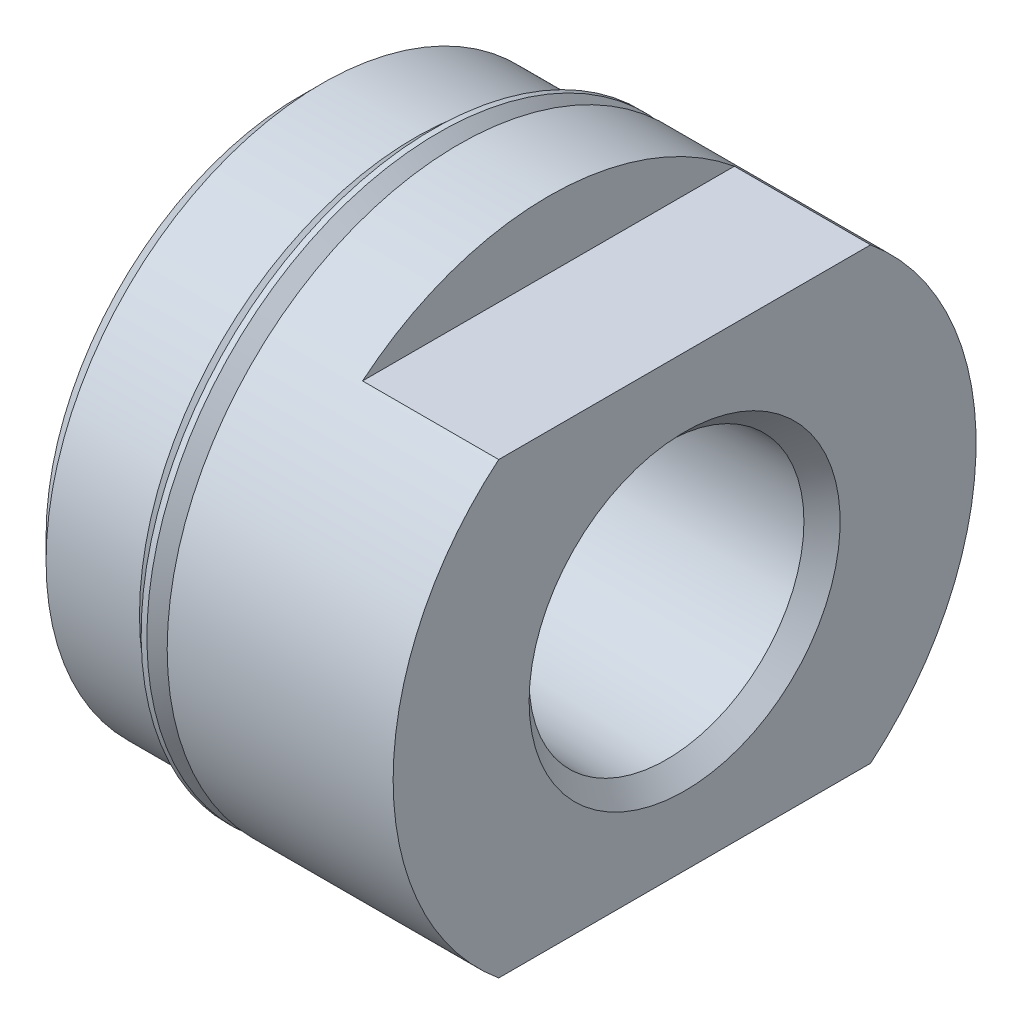
ISO-10303-21;
HEADER;
FILE_DESCRIPTION(('STEP AP214'),'2;1');
FILE_NAME('part.step','',(''),(''),'','','');
FILE_SCHEMA(('AUTOMOTIVE_DESIGN { 1 0 10303 214 1 1 1 1 }'));
ENDSEC;
DATA;
#1=APPLICATION_CONTEXT('core data for automotive mechanical design processes');
#2=APPLICATION_PROTOCOL_DEFINITION('international standard','automotive_design',2000,#1);
#3=PRODUCT_CONTEXT('',#1,'mechanical');
#4=PRODUCT('Part','Part','',(#3));
#5=PRODUCT_RELATED_PRODUCT_CATEGORY('part','',(#4));
#6=PRODUCT_DEFINITION_FORMATION('','',#4);
#7=PRODUCT_DEFINITION_CONTEXT('part definition',#1,'design');
#8=PRODUCT_DEFINITION('design','',#6,#7);
#9=PRODUCT_DEFINITION_SHAPE('','',#8);
#10=(LENGTH_UNIT() NAMED_UNIT(*) SI_UNIT(.MILLI.,.METRE.));
#11=(NAMED_UNIT(*) PLANE_ANGLE_UNIT() SI_UNIT($,.RADIAN.));
#12=(NAMED_UNIT(*) SI_UNIT($,.STERADIAN.) SOLID_ANGLE_UNIT());
#13=UNCERTAINTY_MEASURE_WITH_UNIT(LENGTH_MEASURE(1.E-05),#10,'distance_accuracy_value','');
#14=(GEOMETRIC_REPRESENTATION_CONTEXT(3) GLOBAL_UNCERTAINTY_ASSIGNED_CONTEXT((#13)) GLOBAL_UNIT_ASSIGNED_CONTEXT((#10,
#11,#12)) REPRESENTATION_CONTEXT('',''));
#15=CARTESIAN_POINT('',(0.,0.,0.));
#16=DIRECTION('',(0.,0.,1.));
#17=DIRECTION('',(1.,0.,0.));
#18=AXIS2_PLACEMENT_3D('',#15,#16,#17);
#19=CARTESIAN_POINT('',(13.4874,0.,0.));
#20=DIRECTION('',(-1.,0.,0.));
#21=DIRECTION('',(0.,0.,1.));
#22=AXIS2_PLACEMENT_3D('',#19,#20,#21);
#23=CYLINDRICAL_SURFACE('',#22,8.90905);
#24=CARTESIAN_POINT('',(4.8006,0.,0.));
#25=DIRECTION('',(-1.,0.,0.));
#26=DIRECTION('',(0.,0.,1.));
#27=AXIS2_PLACEMENT_3D('',#24,#25,#26);
#28=CIRCLE('',#27,8.90905);
#29=CARTESIAN_POINT('',(4.8006,0.,8.90905));
#30=VERTEX_POINT('',#29);
#31=EDGE_CURVE('E117',#30,#30,#28,.T.);
#32=ORIENTED_EDGE('',*,*,#31,.F.);
#33=EDGE_LOOP('',(#32));
#34=FACE_BOUND('',#33,.T.);
#35=CARTESIAN_POINT('',(5.18159999999989,0.,0.));
#36=DIRECTION('',(1.,0.,0.));
#37=DIRECTION('',(0.,1.,0.));
#38=AXIS2_PLACEMENT_3D('',#35,#36,#37);
#39=CIRCLE('',#38,8.90905);
#40=CARTESIAN_POINT('',(5.18159999999996,8.90904999999996,0.));
#41=VERTEX_POINT('',#40);
#42=EDGE_CURVE('E11',#41,#41,#39,.T.);
#43=ORIENTED_EDGE('',*,*,#42,.F.);
#44=EDGE_LOOP('',(#43));
#45=FACE_BOUND('',#44,.T.);
#46=ADVANCED_FACE('F41',(#34,#45),#23,.T.);
#47=CARTESIAN_POINT('',(5.5626,8.90905,0.));
#48=DIRECTION('',(1.,0.,0.));
#49=DIRECTION('',(0.,0.,-1.));
#50=AXIS2_PLACEMENT_3D('',#47,#48,#49);
#51=PLANE('',#50);
#52=CARTESIAN_POINT('',(5.5626,0.,0.));
#53=DIRECTION('',(-1.,0.,0.));
#54=DIRECTION('',(0.,0.,1.));
#55=AXIS2_PLACEMENT_3D('',#52,#53,#54);
#56=CIRCLE('',#55,10.2235);
#57=CARTESIAN_POINT('',(5.5626,0.,10.2235));
#58=VERTEX_POINT('',#57);
#59=EDGE_CURVE('E108',#58,#58,#56,.T.);
#60=ORIENTED_EDGE('',*,*,#59,.T.);
#61=EDGE_LOOP('',(#60));
#62=FACE_BOUND('',#61,.T.);
#63=CARTESIAN_POINT('',(5.5626,0.,0.));
#64=DIRECTION('',(1.,0.,0.));
#65=DIRECTION('',(0.,0.,-1.));
#66=AXIS2_PLACEMENT_3D('',#63,#64,#65);
#67=CIRCLE('',#66,9.51204893040247);
#68=CARTESIAN_POINT('',(5.5626,0.,-9.51204893040254));
#69=VERTEX_POINT('',#68);
#70=EDGE_CURVE('E49',#69,#69,#67,.F.);
#71=ORIENTED_EDGE('',*,*,#70,.F.);
#72=EDGE_LOOP('',(#71));
#73=FACE_BOUND('',#72,.T.);
#74=ADVANCED_FACE('F139',(#62,#73),#51,.F.);
#75=CARTESIAN_POINT('',(13.4874,10.2235,0.));
#76=DIRECTION('',(-1.,0.,0.));
#77=DIRECTION('',(0.,0.,1.));
#78=AXIS2_PLACEMENT_3D('',#75,#76,#77);
#79=PLANE('',#78);
#80=CARTESIAN_POINT('',(13.4874000000002,0.,0.));
#81=DIRECTION('',(-1.,0.,0.));
#82=DIRECTION('',(0.,0.,1.));
#83=AXIS2_PLACEMENT_3D('',#80,#81,#82);
#84=CIRCLE('',#83,5.45466392515005);
#85=CARTESIAN_POINT('',(13.4874000000002,0.,5.45466392515005));
#86=VERTEX_POINT('',#85);
#87=EDGE_CURVE('E197',#86,#86,#84,.T.);
#88=ORIENTED_EDGE('',*,*,#87,.T.);
#89=EDGE_LOOP('',(#88));
#90=FACE_BOUND('',#89,.T.);
#91=DIRECTION('',(0.,0.,1.));
#92=VECTOR('',#91,1.);
#93=CARTESIAN_POINT('',(13.4874,7.874,-20.447));
#94=LINE('',#93,#92);
#95=CARTESIAN_POINT('',(13.4874,7.874,-6.52074200149032));
#96=VERTEX_POINT('',#95);
#97=CARTESIAN_POINT('',(13.4874,7.874,6.52074200149032));
#98=VERTEX_POINT('',#97);
#99=EDGE_CURVE('E90',#96,#98,#94,.T.);
#100=ORIENTED_EDGE('',*,*,#99,.T.);
#101=CARTESIAN_POINT('',(13.4874,0.,0.));
#102=DIRECTION('',(-1.,0.,0.));
#103=DIRECTION('',(0.,0.,1.));
#104=AXIS2_PLACEMENT_3D('',#101,#102,#103);
#105=CIRCLE('',#104,10.2235);
#106=CARTESIAN_POINT('',(13.4874,-7.874,6.52074200149032));
#107=VERTEX_POINT('',#106);
#108=EDGE_CURVE('E99',#107,#98,#105,.T.);
#109=ORIENTED_EDGE('',*,*,#108,.F.);
#110=DIRECTION('',(0.,0.,-1.));
#111=VECTOR('',#110,1.);
#112=CARTESIAN_POINT('',(13.4874,-7.874,20.447));
#113=LINE('',#112,#111);
#114=CARTESIAN_POINT('',(13.4874,-7.874,-6.52074200149032));
#115=VERTEX_POINT('',#114);
#116=EDGE_CURVE('E80',#107,#115,#113,.T.);
#117=ORIENTED_EDGE('',*,*,#116,.T.);
#118=EDGE_CURVE('E105',#96,#115,#105,.T.);
#119=ORIENTED_EDGE('',*,*,#118,.F.);
#120=EDGE_LOOP('',(#100,#109,#117,#119));
#121=FACE_BOUND('',#120,.T.);
#122=ADVANCED_FACE('F104',(#90,#121),#79,.F.);
#123=CARTESIAN_POINT('',(13.4874,0.,0.));
#124=DIRECTION('',(-1.,0.,0.));
#125=DIRECTION('',(0.,0.,1.));
#126=AXIS2_PLACEMENT_3D('',#123,#124,#125);
#127=CYLINDRICAL_SURFACE('',#126,10.2235);
#128=ORIENTED_EDGE('',*,*,#59,.F.);
#129=EDGE_LOOP('',(#128));
#130=FACE_BOUND('',#129,.T.);
#131=DIRECTION('',(-1.,0.,0.));
#132=VECTOR('',#131,1.);
#133=CARTESIAN_POINT('',(13.4874,7.874,-6.52074200149032));
#134=LINE('',#133,#132);
#135=CARTESIAN_POINT('',(8.7122,7.874,-6.52074200149032));
#136=VERTEX_POINT('',#135);
#137=EDGE_CURVE('E133',#96,#136,#134,.T.);
#138=ORIENTED_EDGE('',*,*,#137,.F.);
#139=ORIENTED_EDGE('',*,*,#118,.T.);
#140=DIRECTION('',(-1.,0.,0.));
#141=VECTOR('',#140,1.);
#142=CARTESIAN_POINT('',(13.4874,-7.874,-6.52074200149032));
#143=LINE('',#142,#141);
#144=CARTESIAN_POINT('',(8.7122,-7.874,-6.52074200149032));
#145=VERTEX_POINT('',#144);
#146=EDGE_CURVE('E85',#145,#115,#143,.F.);
#147=ORIENTED_EDGE('',*,*,#146,.F.);
#148=CARTESIAN_POINT('',(8.7122,0.,0.));
#149=DIRECTION('',(1.,0.,0.));
#150=DIRECTION('',(0.,0.,-1.));
#151=AXIS2_PLACEMENT_3D('',#148,#149,#150);
#152=CIRCLE('',#151,10.2235);
#153=CARTESIAN_POINT('',(8.7122,-7.874,6.52074200149032));
#154=VERTEX_POINT('',#153);
#155=EDGE_CURVE('E100',#154,#145,#152,.T.);
#156=ORIENTED_EDGE('',*,*,#155,.F.);
#157=DIRECTION('',(-1.,0.,0.));
#158=VECTOR('',#157,1.);
#159=CARTESIAN_POINT('',(13.4874,-7.874,6.52074200149032));
#160=LINE('',#159,#158);
#161=EDGE_CURVE('E83',#107,#154,#160,.T.);
#162=ORIENTED_EDGE('',*,*,#161,.F.);
#163=ORIENTED_EDGE('',*,*,#108,.T.);
#164=DIRECTION('',(-1.,0.,0.));
#165=VECTOR('',#164,1.);
#166=CARTESIAN_POINT('',(13.4874,7.874,6.52074200149032));
#167=LINE('',#166,#165);
#168=CARTESIAN_POINT('',(8.7122,7.874,6.52074200149032));
#169=VERTEX_POINT('',#168);
#170=EDGE_CURVE('E101',#169,#98,#167,.F.);
#171=ORIENTED_EDGE('',*,*,#170,.F.);
#172=EDGE_CURVE('E130',#136,#169,#152,.T.);
#173=ORIENTED_EDGE('',*,*,#172,.F.);
#174=EDGE_LOOP('',(#138,#139,#147,#156,#162,#163,#171,#173));
#175=FACE_BOUND('',#174,.T.);
#176=ADVANCED_FACE('F97',(#130,#175),#127,.T.);
#177=CARTESIAN_POINT('',(0.,0.,0.));
#178=DIRECTION('',(1.,0.,0.));
#179=DIRECTION('',(0.,0.,-1.));
#180=AXIS2_PLACEMENT_3D('',#177,#178,#179);
#181=PLANE('',#180);
#182=CARTESIAN_POINT('',(0.,0.,0.));
#183=DIRECTION('',(-1.,0.,0.));
#184=DIRECTION('',(0.,0.,1.));
#185=AXIS2_PLACEMENT_3D('',#182,#183,#184);
#186=CIRCLE('',#185,8.90905);
#187=CARTESIAN_POINT('',(0.,0.,8.90905));
#188=VERTEX_POINT('',#187);
#189=EDGE_CURVE('E126',#188,#188,#186,.T.);
#190=ORIENTED_EDGE('',*,*,#189,.T.);
#191=EDGE_LOOP('',(#190));
#192=FACE_BOUND('',#191,.T.);
#193=CARTESIAN_POINT('',(0.,0.,0.));
#194=DIRECTION('',(1.,0.,0.));
#195=DIRECTION('',(0.,0.,-1.));
#196=AXIS2_PLACEMENT_3D('',#193,#194,#195);
#197=CIRCLE('',#196,4.41840547597906);
#198=CARTESIAN_POINT('',(0.,0.,-4.41840547597906));
#199=VERTEX_POINT('',#198);
#200=EDGE_CURVE('E106',#199,#199,#197,.F.);
#201=ORIENTED_EDGE('',*,*,#200,.F.);
#202=EDGE_LOOP('',(#201));
#203=FACE_BOUND('',#202,.T.);
#204=ADVANCED_FACE('F43',(#192,#203),#181,.F.);
#205=CARTESIAN_POINT('',(0.762000000000001,0.,0.));
#206=DIRECTION('',(1.,0.,0.));
#207=DIRECTION('',(0.,0.,-1.));
#208=AXIS2_PLACEMENT_3D('',#205,#206,#207);
#209=CONICAL_SURFACE('',#208,9.67105,0.785398163397447);
#210=ORIENTED_EDGE('',*,*,#189,.F.);
#211=EDGE_LOOP('',(#210));
#212=FACE_BOUND('',#211,.T.);
#213=CARTESIAN_POINT('',(0.762000000000001,0.,0.));
#214=DIRECTION('',(-1.,0.,0.));
#215=DIRECTION('',(0.,0.,1.));
#216=AXIS2_PLACEMENT_3D('',#213,#214,#215);
#217=CIRCLE('',#216,9.67105);
#218=CARTESIAN_POINT('',(0.762000000000001,0.,9.67105));
#219=VERTEX_POINT('',#218);
#220=EDGE_CURVE('E123',#219,#219,#217,.T.);
#221=ORIENTED_EDGE('',*,*,#220,.T.);
#222=EDGE_LOOP('',(#221));
#223=FACE_BOUND('',#222,.T.);
#224=ADVANCED_FACE('F160',(#212,#223),#209,.T.);
#225=CARTESIAN_POINT('',(13.4874,0.,0.));
#226=DIRECTION('',(-1.,0.,0.));
#227=DIRECTION('',(0.,0.,1.));
#228=AXIS2_PLACEMENT_3D('',#225,#226,#227);
#229=CYLINDRICAL_SURFACE('',#228,9.67105);
#230=ORIENTED_EDGE('',*,*,#220,.F.);
#231=EDGE_LOOP('',(#230));
#232=FACE_BOUND('',#231,.T.);
#233=CARTESIAN_POINT('',(4.0386,0.,0.));
#234=DIRECTION('',(-1.,0.,0.));
#235=DIRECTION('',(0.,0.,1.));
#236=AXIS2_PLACEMENT_3D('',#233,#234,#235);
#237=CIRCLE('',#236,9.67105);
#238=CARTESIAN_POINT('',(4.0386,0.,9.67105));
#239=VERTEX_POINT('',#238);
#240=EDGE_CURVE('E120',#239,#239,#237,.T.);
#241=ORIENTED_EDGE('',*,*,#240,.T.);
#242=EDGE_LOOP('',(#241));
#243=FACE_BOUND('',#242,.T.);
#244=ADVANCED_FACE('F157',(#232,#243),#229,.T.);
#245=CARTESIAN_POINT('',(4.8006,0.,0.));
#246=DIRECTION('',(-1.,0.,0.));
#247=DIRECTION('',(0.,0.,1.));
#248=AXIS2_PLACEMENT_3D('',#245,#246,#247);
#249=CONICAL_SURFACE('',#248,8.90905,0.785398163397447);
#250=ORIENTED_EDGE('',*,*,#240,.F.);
#251=EDGE_LOOP('',(#250));
#252=FACE_BOUND('',#251,.T.);
#253=ORIENTED_EDGE('',*,*,#31,.T.);
#254=EDGE_LOOP('',(#253));
#255=FACE_BOUND('',#254,.T.);
#256=ADVANCED_FACE('F153',(#252,#255),#249,.T.);
#257=CARTESIAN_POINT('',(12.852387191015,0.,0.));
#258=DIRECTION('',(1.,0.,0.));
#259=DIRECTION('',(0.,0.,-1.));
#260=AXIS2_PLACEMENT_3D('',#257,#258,#259);
#261=CONICAL_SURFACE('',#260,4.8196511161649,0.0312094049979799);
#262=CARTESIAN_POINT('',(12.852387191015,0.,0.));
#263=DIRECTION('',(-1.,0.,0.));
#264=DIRECTION('',(0.,0.,1.));
#265=AXIS2_PLACEMENT_3D('',#262,#263,#264);
#266=CIRCLE('',#265,4.8196511161649);
#267=CARTESIAN_POINT('',(12.852387191015,0.,4.8196511161649));
#268=VERTEX_POINT('',#267);
#269=EDGE_CURVE('E110',#268,#268,#266,.T.);
#270=ORIENTED_EDGE('',*,*,#269,.F.);
#271=EDGE_LOOP('',(#270));
#272=FACE_BOUND('',#271,.T.);
#273=ORIENTED_EDGE('',*,*,#200,.T.);
#274=EDGE_LOOP('',(#273));
#275=FACE_BOUND('',#274,.T.);
#276=ADVANCED_FACE('F156',(#272,#275),#261,.F.);
#277=CARTESIAN_POINT('',(13.4874000000002,0.,0.));
#278=DIRECTION('',(1.,0.,0.));
#279=DIRECTION('',(0.,0.,-1.));
#280=AXIS2_PLACEMENT_3D('',#277,#278,#279);
#281=CONICAL_SURFACE('',#280,5.45466392515005,0.785398163397449);
#282=ORIENTED_EDGE('',*,*,#269,.T.);
#283=EDGE_LOOP('',(#282));
#284=FACE_BOUND('',#283,.T.);
#285=ORIENTED_EDGE('',*,*,#87,.F.);
#286=EDGE_LOOP('',(#285));
#287=FACE_BOUND('',#286,.T.);
#288=ADVANCED_FACE('F204',(#284,#287),#281,.F.);
#289=CARTESIAN_POINT('',(8.7122,-7.874,20.447));
#290=DIRECTION('',(0.,-1.,0.));
#291=DIRECTION('',(0.,0.,-1.));
#292=AXIS2_PLACEMENT_3D('',#289,#290,#291);
#293=PLANE('',#292);
#294=ORIENTED_EDGE('',*,*,#161,.T.);
#295=DIRECTION('',(0.,0.,-1.));
#296=VECTOR('',#295,1.);
#297=CARTESIAN_POINT('',(8.7122,-7.874,20.447));
#298=LINE('',#297,#296);
#299=EDGE_CURVE('E64',#154,#145,#298,.T.);
#300=ORIENTED_EDGE('',*,*,#299,.T.);
#301=ORIENTED_EDGE('',*,*,#146,.T.);
#302=ORIENTED_EDGE('',*,*,#116,.F.);
#303=EDGE_LOOP('',(#294,#300,#301,#302));
#304=FACE_BOUND('',#303,.T.);
#305=ADVANCED_FACE('F82',(#304),#293,.T.);
#306=CARTESIAN_POINT('',(8.7122,0.,0.));
#307=DIRECTION('',(1.,0.,0.));
#308=DIRECTION('',(0.,0.,-1.));
#309=AXIS2_PLACEMENT_3D('',#306,#307,#308);
#310=PLANE('',#309);
#311=ORIENTED_EDGE('',*,*,#155,.T.);
#312=ORIENTED_EDGE('',*,*,#299,.F.);
#313=EDGE_LOOP('',(#311,#312));
#314=FACE_BOUND('',#313,.T.);
#315=ADVANCED_FACE('F221',(#314),#310,.T.);
#316=ORIENTED_EDGE('',*,*,#172,.T.);
#317=DIRECTION('',(0.,0.,1.));
#318=VECTOR('',#317,1.);
#319=CARTESIAN_POINT('',(8.7122,7.874,-20.447));
#320=LINE('',#319,#318);
#321=EDGE_CURVE('E56',#136,#169,#320,.T.);
#322=ORIENTED_EDGE('',*,*,#321,.F.);
#323=EDGE_LOOP('',(#316,#322));
#324=FACE_BOUND('',#323,.T.);
#325=ADVANCED_FACE('F217',(#324),#310,.T.);
#326=CARTESIAN_POINT('',(8.7122,7.874,-20.447));
#327=DIRECTION('',(0.,1.,0.));
#328=DIRECTION('',(0.,0.,1.));
#329=AXIS2_PLACEMENT_3D('',#326,#327,#328);
#330=PLANE('',#329);
#331=ORIENTED_EDGE('',*,*,#137,.T.);
#332=ORIENTED_EDGE('',*,*,#321,.T.);
#333=ORIENTED_EDGE('',*,*,#170,.T.);
#334=ORIENTED_EDGE('',*,*,#99,.F.);
#335=EDGE_LOOP('',(#331,#332,#333,#334));
#336=FACE_BOUND('',#335,.T.);
#337=ADVANCED_FACE('F220',(#336),#330,.T.);
#338=CARTESIAN_POINT('',(5.5625999999999,0.,0.));
#339=DIRECTION('',(-1.,0.,0.));
#340=DIRECTION('',(0.,-1.,0.));
#341=AXIS2_PLACEMENT_3D('',#338,#339,#340);
#342=CYLINDRICAL_SURFACE('',#341,10.2235);
#343=CARTESIAN_POINT('',(4.64794893040242,0.,0.));
#344=DIRECTION('',(-1.,0.,0.));
#345=DIRECTION('',(0.,-1.,0.));
#346=AXIS2_PLACEMENT_3D('',#343,#344,#345);
#347=CIRCLE('',#346,10.2235);
#348=CARTESIAN_POINT('',(4.64794893040235,-10.2235000000001,0.));
#349=VERTEX_POINT('',#348);
#350=EDGE_CURVE('E250',#349,#349,#347,.T.);
#351=ORIENTED_EDGE('',*,*,#350,.F.);
#352=EDGE_LOOP('',(#351));
#353=FACE_BOUND('',#352,.T.);
#354=CARTESIAN_POINT('',(4.85114893040242,0.,0.));
#355=DIRECTION('',(-1.,0.,0.));
#356=DIRECTION('',(0.,-1.,0.));
#357=AXIS2_PLACEMENT_3D('',#354,#355,#356);
#358=CIRCLE('',#357,10.2235);
#359=CARTESIAN_POINT('',(4.85114893040235,-10.2235000000001,0.));
#360=VERTEX_POINT('',#359);
#361=EDGE_CURVE('E91',#360,#360,#358,.T.);
#362=ORIENTED_EDGE('',*,*,#361,.T.);
#363=EDGE_LOOP('',(#362));
#364=FACE_BOUND('',#363,.T.);
#365=ADVANCED_FACE('F227',(#353,#364),#342,.T.);
#366=CARTESIAN_POINT('',(5.56259999999993,0.,0.));
#367=DIRECTION('',(-1.,0.,0.));
#368=DIRECTION('',(0.,-1.,0.));
#369=AXIS2_PLACEMENT_3D('',#366,#367,#368);
#370=CONICAL_SURFACE('',#369,9.51204893040254,0.785398163397441);
#371=ORIENTED_EDGE('',*,*,#361,.F.);
#372=EDGE_LOOP('',(#371));
#373=FACE_BOUND('',#372,.T.);
#374=ORIENTED_EDGE('',*,*,#70,.T.);
#375=EDGE_LOOP('',(#374));
#376=FACE_BOUND('',#375,.T.);
#377=ADVANCED_FACE('F137',(#373,#376),#370,.T.);
#378=CARTESIAN_POINT('',(5.44011280605353,0.,0.));
#379=DIRECTION('',(1.,0.,0.));
#380=DIRECTION('',(0.,1.,0.));
#381=AXIS2_PLACEMENT_3D('',#378,#379,#380);
#382=CONICAL_SURFACE('',#381,9.16756280605364,0.785398163397455);
#383=ORIENTED_EDGE('',*,*,#42,.T.);
#384=EDGE_LOOP('',(#383));
#385=FACE_BOUND('',#384,.T.);
#386=CARTESIAN_POINT('',(5.44011280605353,0.,0.));
#387=DIRECTION('',(-1.,0.,0.));
#388=DIRECTION('',(0.,-1.,0.));
#389=AXIS2_PLACEMENT_3D('',#386,#387,#388);
#390=CIRCLE('',#389,9.16756280605364);
#391=CARTESIAN_POINT('',(5.44011280605346,-9.16756280605368,0.));
#392=VERTEX_POINT('',#391);
#393=EDGE_CURVE('E185',#392,#392,#390,.T.);
#394=ORIENTED_EDGE('',*,*,#393,.T.);
#395=EDGE_LOOP('',(#394));
#396=FACE_BOUND('',#395,.T.);
#397=ADVANCED_FACE('F178',(#385,#396),#382,.T.);
#398=CARTESIAN_POINT('',(5.35031024484292,0.,0.));
#399=DIRECTION('',(-1.,0.,0.));
#400=DIRECTION('',(0.,-1.,0.));
#401=AXIS2_PLACEMENT_3D('',#398,#399,#400);
#402=TOROIDAL_SURFACE('',#401,9.25736536726429,0.126999999999916);
#403=ORIENTED_EDGE('',*,*,#393,.F.);
#404=EDGE_LOOP('',(#403));
#405=FACE_BOUND('',#404,.T.);
#406=CARTESIAN_POINT('',(5.44011280605353,0.,0.));
#407=DIRECTION('',(-1.,0.,0.));
#408=DIRECTION('',(0.,-1.,0.));
#409=AXIS2_PLACEMENT_3D('',#406,#407,#408);
#410=CIRCLE('',#409,9.34716792847494);
#411=CARTESIAN_POINT('',(5.44011280605346,-9.34716792847498,0.));
#412=VERTEX_POINT('',#411);
#413=EDGE_CURVE('E187',#412,#412,#410,.T.);
#414=ORIENTED_EDGE('',*,*,#413,.T.);
#415=EDGE_LOOP('',(#414));
#416=FACE_BOUND('',#415,.T.);
#417=ADVANCED_FACE('F181',(#405,#416),#402,.F.);
#418=CARTESIAN_POINT('',(4.64794893040243,0.,0.));
#419=DIRECTION('',(-1.,0.,0.));
#420=DIRECTION('',(0.,-1.,0.));
#421=AXIS2_PLACEMENT_3D('',#418,#419,#420);
#422=CONICAL_SURFACE('',#421,10.139331804126,0.785398163397442);
#423=ORIENTED_EDGE('',*,*,#413,.F.);
#424=EDGE_LOOP('',(#423));
#425=FACE_BOUND('',#424,.T.);
#426=CARTESIAN_POINT('',(4.64794893040243,0.,0.));
#427=DIRECTION('',(-1.,0.,0.));
#428=DIRECTION('',(0.,-1.,0.));
#429=AXIS2_PLACEMENT_3D('',#426,#427,#428);
#430=CIRCLE('',#429,10.139331804126);
#431=CARTESIAN_POINT('',(4.64794893040235,-10.1393318041261,0.));
#432=VERTEX_POINT('',#431);
#433=EDGE_CURVE('E192',#432,#432,#430,.T.);
#434=ORIENTED_EDGE('',*,*,#433,.T.);
#435=EDGE_LOOP('',(#434));
#436=FACE_BOUND('',#435,.T.);
#437=ADVANCED_FACE('F236',(#425,#436),#422,.F.);
#438=CARTESIAN_POINT('',(4.6479489304025,10.2235,0.));
#439=DIRECTION('',(1.,0.,0.));
#440=DIRECTION('',(0.,1.,0.));
#441=AXIS2_PLACEMENT_3D('',#438,#439,#440);
#442=PLANE('',#441);
#443=ORIENTED_EDGE('',*,*,#433,.F.);
#444=EDGE_LOOP('',(#443));
#445=FACE_BOUND('',#444,.T.);
#446=ORIENTED_EDGE('',*,*,#350,.T.);
#447=EDGE_LOOP('',(#446));
#448=FACE_BOUND('',#447,.T.);
#449=ADVANCED_FACE('F239',(#445,#448),#442,.F.);
#450=CLOSED_SHELL('',(#46,#74,#122,#176,#204,#224,#244,#256,#276,#288,#305,#315,#325,#337,#365,
#377,#397,#417,#437,#449));
#451=MANIFOLD_SOLID_BREP('B2',#450);
#452=ADVANCED_BREP_SHAPE_REPRESENTATION('',(#18,#451),#14);
#453=SHAPE_DEFINITION_REPRESENTATION(#9,#452);
ENDSEC;
END-ISO-10303-21;
